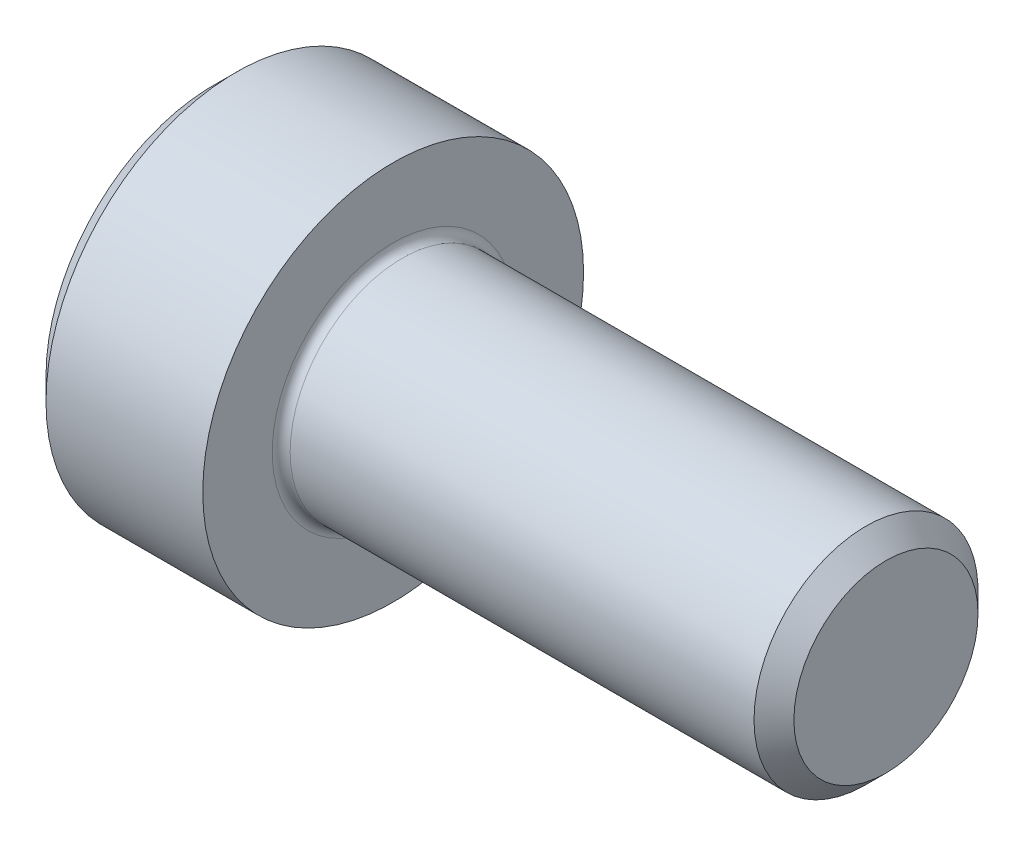
ISO-10303-21;
HEADER;
FILE_DESCRIPTION(('STEP AP214'),'2;1');
FILE_NAME('part.step','',(''),(''),'','','');
FILE_SCHEMA(('AUTOMOTIVE_DESIGN { 1 0 10303 214 1 1 1 1 }'));
ENDSEC;
DATA;
#1=APPLICATION_CONTEXT('core data for automotive mechanical design processes');
#2=APPLICATION_PROTOCOL_DEFINITION('international standard','automotive_design',2000,#1);
#3=PRODUCT_CONTEXT('',#1,'mechanical');
#4=PRODUCT('Part','Part','',(#3));
#5=PRODUCT_RELATED_PRODUCT_CATEGORY('part','',(#4));
#6=PRODUCT_DEFINITION_FORMATION('','',#4);
#7=PRODUCT_DEFINITION_CONTEXT('part definition',#1,'design');
#8=PRODUCT_DEFINITION('design','',#6,#7);
#9=PRODUCT_DEFINITION_SHAPE('','',#8);
#10=(LENGTH_UNIT() NAMED_UNIT(*) SI_UNIT(.MILLI.,.METRE.));
#11=(NAMED_UNIT(*) PLANE_ANGLE_UNIT() SI_UNIT($,.RADIAN.));
#12=(NAMED_UNIT(*) SI_UNIT($,.STERADIAN.) SOLID_ANGLE_UNIT());
#13=UNCERTAINTY_MEASURE_WITH_UNIT(LENGTH_MEASURE(1.E-05),#10,'distance_accuracy_value','');
#14=(GEOMETRIC_REPRESENTATION_CONTEXT(3) GLOBAL_UNCERTAINTY_ASSIGNED_CONTEXT((#13)) GLOBAL_UNIT_ASSIGNED_CONTEXT((#10,
#11,#12)) REPRESENTATION_CONTEXT('',''));
#15=CARTESIAN_POINT('',(0.,0.,0.));
#16=DIRECTION('',(0.,0.,1.));
#17=DIRECTION('',(1.,0.,0.));
#18=AXIS2_PLACEMENT_3D('',#15,#16,#17);
#19=CARTESIAN_POINT('',(0.,0.,0.));
#20=DIRECTION('',(-1.,0.,0.));
#21=DIRECTION('',(0.,0.,1.));
#22=AXIS2_PLACEMENT_3D('',#19,#20,#21);
#23=PLANE('',#22);
#24=DIRECTION('',(0.,-0.499999999999999,0.866025403784439));
#25=VECTOR('',#24,1.);
#26=CARTESIAN_POINT('',(0.,2.35789849937043,0.));
#27=LINE('',#26,#25);
#28=CARTESIAN_POINT('',(0.,2.35789849937043,0.));
#29=VERTEX_POINT('',#28);
#30=CARTESIAN_POINT('',(0.,1.17894924968522,2.042));
#31=VERTEX_POINT('',#30);
#32=EDGE_CURVE('E262',#29,#31,#27,.T.);
#33=ORIENTED_EDGE('',*,*,#32,.T.);
#34=DIRECTION('',(0.,1.,0.));
#35=VECTOR('',#34,1.);
#36=CARTESIAN_POINT('',(0.,-1.17894924968522,2.042));
#37=LINE('',#36,#35);
#38=CARTESIAN_POINT('',(0.,-1.17894924968522,2.042));
#39=VERTEX_POINT('',#38);
#40=EDGE_CURVE('E133',#39,#31,#37,.T.);
#41=ORIENTED_EDGE('',*,*,#40,.F.);
#42=DIRECTION('',(0.,-0.500000000000001,-0.866025403784438));
#43=VECTOR('',#42,1.);
#44=CARTESIAN_POINT('',(0.,-1.17894924968522,2.042));
#45=LINE('',#44,#43);
#46=CARTESIAN_POINT('',(0.,-2.35789849937043,0.));
#47=VERTEX_POINT('',#46);
#48=EDGE_CURVE('E265',#39,#47,#45,.T.);
#49=ORIENTED_EDGE('',*,*,#48,.T.);
#50=DIRECTION('',(0.,0.499999999999998,-0.86602540378444));
#51=VECTOR('',#50,1.);
#52=CARTESIAN_POINT('',(0.,-2.35789849937043,0.));
#53=LINE('',#52,#51);
#54=CARTESIAN_POINT('',(0.,-1.17894924968522,-2.042));
#55=VERTEX_POINT('',#54);
#56=EDGE_CURVE('E268',#47,#55,#53,.T.);
#57=ORIENTED_EDGE('',*,*,#56,.T.);
#58=DIRECTION('',(0.,-1.,0.));
#59=VECTOR('',#58,1.);
#60=CARTESIAN_POINT('',(0.,1.17894924968521,-2.042));
#61=LINE('',#60,#59);
#62=CARTESIAN_POINT('',(0.,1.17894924968521,-2.042));
#63=VERTEX_POINT('',#62);
#64=EDGE_CURVE('E271',#63,#55,#61,.T.);
#65=ORIENTED_EDGE('',*,*,#64,.F.);
#66=DIRECTION('',(0.,-0.500000000000001,-0.866025403784438));
#67=VECTOR('',#66,1.);
#68=CARTESIAN_POINT('',(0.,2.35789849937043,0.));
#69=LINE('',#68,#67);
#70=EDGE_CURVE('E128',#29,#63,#69,.T.);
#71=ORIENTED_EDGE('',*,*,#70,.F.);
#72=EDGE_LOOP('',(#33,#41,#49,#57,#65,#71));
#73=FACE_BOUND('',#72,.T.);
#74=CARTESIAN_POINT('',(0.,0.,0.));
#75=DIRECTION('',(-1.,0.,0.));
#76=DIRECTION('',(0.,0.,1.));
#77=AXIS2_PLACEMENT_3D('',#74,#75,#76);
#78=CIRCLE('',#77,3.75);
#79=CARTESIAN_POINT('',(0.,0.,3.75));
#80=VERTEX_POINT('',#79);
#81=EDGE_CURVE('E157',#80,#80,#78,.T.);
#82=ORIENTED_EDGE('',*,*,#81,.T.);
#83=EDGE_LOOP('',(#82));
#84=FACE_BOUND('',#83,.T.);
#85=ADVANCED_FACE('F37',(#73,#84),#23,.T.);
#86=CARTESIAN_POINT('',(0.,0.,0.));
#87=DIRECTION('',(1.,0.,0.));
#88=DIRECTION('',(0.,0.,-1.));
#89=AXIS2_PLACEMENT_3D('',#86,#87,#88);
#90=CONICAL_SURFACE('',#89,3.75,0.78539816339745);
#91=CARTESIAN_POINT('',(0.5,0.,0.));
#92=DIRECTION('',(-1.,0.,0.));
#93=DIRECTION('',(0.,0.,1.));
#94=AXIS2_PLACEMENT_3D('',#91,#92,#93);
#95=CIRCLE('',#94,4.25);
#96=CARTESIAN_POINT('',(0.5,0.,4.25));
#97=VERTEX_POINT('',#96);
#98=EDGE_CURVE('E154',#97,#97,#95,.T.);
#99=ORIENTED_EDGE('',*,*,#98,.T.);
#100=EDGE_LOOP('',(#99));
#101=FACE_BOUND('',#100,.T.);
#102=ORIENTED_EDGE('',*,*,#81,.F.);
#103=EDGE_LOOP('',(#102));
#104=FACE_BOUND('',#103,.T.);
#105=ADVANCED_FACE('F178',(#101,#104),#90,.T.);
#106=CARTESIAN_POINT('',(-31.75,0.,0.));
#107=DIRECTION('',(-1.,0.,0.));
#108=DIRECTION('',(0.,0.,1.));
#109=AXIS2_PLACEMENT_3D('',#106,#107,#108);
#110=CYLINDRICAL_SURFACE('',#109,4.25);
#111=CARTESIAN_POINT('',(4.,0.,0.));
#112=DIRECTION('',(-1.,0.,0.));
#113=DIRECTION('',(0.,0.,1.));
#114=AXIS2_PLACEMENT_3D('',#111,#112,#113);
#115=CIRCLE('',#114,4.25);
#116=CARTESIAN_POINT('',(4.,0.,4.25));
#117=VERTEX_POINT('',#116);
#118=EDGE_CURVE('E151',#117,#117,#115,.T.);
#119=ORIENTED_EDGE('',*,*,#118,.T.);
#120=EDGE_LOOP('',(#119));
#121=FACE_BOUND('',#120,.T.);
#122=ORIENTED_EDGE('',*,*,#98,.F.);
#123=EDGE_LOOP('',(#122));
#124=FACE_BOUND('',#123,.T.);
#125=ADVANCED_FACE('F183',(#121,#124),#110,.T.);
#126=CARTESIAN_POINT('',(4.,4.25,0.));
#127=DIRECTION('',(1.,0.,0.));
#128=DIRECTION('',(0.,0.,-1.));
#129=AXIS2_PLACEMENT_3D('',#126,#127,#128);
#130=PLANE('',#129);
#131=CARTESIAN_POINT('',(4.,0.,0.));
#132=DIRECTION('',(1.,0.,0.));
#133=DIRECTION('',(0.,0.,-1.));
#134=AXIS2_PLACEMENT_3D('',#131,#132,#133);
#135=CIRCLE('',#134,2.69999999999994);
#136=CARTESIAN_POINT('',(4.,0.,-2.69999999999994));
#137=VERTEX_POINT('',#136);
#138=EDGE_CURVE('E45',#137,#137,#135,.F.);
#139=ORIENTED_EDGE('',*,*,#138,.T.);
#140=EDGE_LOOP('',(#139));
#141=FACE_BOUND('',#140,.T.);
#142=ORIENTED_EDGE('',*,*,#118,.F.);
#143=EDGE_LOOP('',(#142));
#144=FACE_BOUND('',#143,.T.);
#145=ADVANCED_FACE('F162',(#141,#144),#130,.T.);
#146=CARTESIAN_POINT('',(-31.75,0.,0.));
#147=DIRECTION('',(-1.,0.,0.));
#148=DIRECTION('',(0.,0.,1.));
#149=AXIS2_PLACEMENT_3D('',#146,#147,#148);
#150=CYLINDRICAL_SURFACE('',#149,2.49999999999994);
#151=CARTESIAN_POINT('',(4.2,0.,0.));
#152=DIRECTION('',(1.,0.,0.));
#153=DIRECTION('',(0.,0.,-1.));
#154=AXIS2_PLACEMENT_3D('',#151,#152,#153);
#155=CIRCLE('',#154,2.49999999999994);
#156=CARTESIAN_POINT('',(4.2,0.,-2.49999999999994));
#157=VERTEX_POINT('',#156);
#158=EDGE_CURVE('E11',#157,#157,#155,.T.);
#159=ORIENTED_EDGE('',*,*,#158,.T.);
#160=EDGE_LOOP('',(#159));
#161=FACE_BOUND('',#160,.T.);
#162=CARTESIAN_POINT('',(14.5549999999999,0.,0.));
#163=DIRECTION('',(-1.,0.,0.));
#164=DIRECTION('',(0.,0.,1.));
#165=AXIS2_PLACEMENT_3D('',#162,#163,#164);
#166=CIRCLE('',#165,2.49999999999992);
#167=CARTESIAN_POINT('',(14.5549999999999,0.,2.49999999999992));
#168=VERTEX_POINT('',#167);
#169=EDGE_CURVE('E148',#168,#168,#166,.T.);
#170=ORIENTED_EDGE('',*,*,#169,.T.);
#171=EDGE_LOOP('',(#170));
#172=FACE_BOUND('',#171,.T.);
#173=ADVANCED_FACE('F193',(#161,#172),#150,.T.);
#174=CARTESIAN_POINT('',(15.,0.,0.));
#175=DIRECTION('',(-1.,0.,0.));
#176=DIRECTION('',(0.,0.,1.));
#177=AXIS2_PLACEMENT_3D('',#174,#175,#176);
#178=CONICAL_SURFACE('',#177,2.055,0.785398163397299);
#179=ORIENTED_EDGE('',*,*,#169,.F.);
#180=EDGE_LOOP('',(#179));
#181=FACE_BOUND('',#180,.T.);
#182=CARTESIAN_POINT('',(15.,0.,0.));
#183=DIRECTION('',(-1.,0.,0.));
#184=DIRECTION('',(0.,0.,1.));
#185=AXIS2_PLACEMENT_3D('',#182,#183,#184);
#186=CIRCLE('',#185,2.055);
#187=CARTESIAN_POINT('',(15.,0.,2.055));
#188=VERTEX_POINT('',#187);
#189=EDGE_CURVE('E144',#188,#188,#186,.T.);
#190=ORIENTED_EDGE('',*,*,#189,.T.);
#191=EDGE_LOOP('',(#190));
#192=FACE_BOUND('',#191,.T.);
#193=ADVANCED_FACE('F173',(#181,#192),#178,.T.);
#194=CARTESIAN_POINT('',(15.,2.055,0.));
#195=DIRECTION('',(1.,0.,0.));
#196=DIRECTION('',(0.,0.,-1.));
#197=AXIS2_PLACEMENT_3D('',#194,#195,#196);
#198=PLANE('',#197);
#199=ORIENTED_EDGE('',*,*,#189,.F.);
#200=EDGE_LOOP('',(#199));
#201=FACE_BOUND('',#200,.T.);
#202=ADVANCED_FACE('F166',(#201),#198,.T.);
#203=CARTESIAN_POINT('',(4.2,0.,0.));
#204=DIRECTION('',(1.,0.,0.));
#205=DIRECTION('',(0.,0.,-1.));
#206=AXIS2_PLACEMENT_3D('',#203,#204,#205);
#207=TOROIDAL_SURFACE('',#206,2.69999999999994,0.2);
#208=ORIENTED_EDGE('',*,*,#158,.F.);
#209=EDGE_LOOP('',(#208));
#210=FACE_BOUND('',#209,.T.);
#211=ORIENTED_EDGE('',*,*,#138,.F.);
#212=EDGE_LOOP('',(#211));
#213=FACE_BOUND('',#212,.T.);
#214=ADVANCED_FACE('F39',(#210,#213),#207,.F.);
#215=CARTESIAN_POINT('',(2.5,2.35789849937043,0.));
#216=DIRECTION('',(0.,-0.866025403784439,-0.499999999999999));
#217=DIRECTION('',(0.,0.499999999999999,-0.866025403784439));
#218=AXIS2_PLACEMENT_3D('',#215,#216,#217);
#219=PLANE('',#218);
#220=ORIENTED_EDGE('',*,*,#32,.F.);
#221=DIRECTION('',(-1.,0.,0.));
#222=VECTOR('',#221,1.);
#223=CARTESIAN_POINT('',(2.5,2.35789849937043,0.));
#224=LINE('',#223,#222);
#225=CARTESIAN_POINT('',(2.5,2.35789849937043,0.));
#226=VERTEX_POINT('',#225);
#227=EDGE_CURVE('E252',#226,#29,#224,.T.);
#228=ORIENTED_EDGE('',*,*,#227,.F.);
#229=DIRECTION('',(0.,-0.499999999999999,0.866025403784439));
#230=VECTOR('',#229,1.);
#231=CARTESIAN_POINT('',(2.5,2.35789849937043,0.));
#232=LINE('',#231,#230);
#233=CARTESIAN_POINT('',(2.5,1.76842387452782,1.021));
#234=VERTEX_POINT('',#233);
#235=EDGE_CURVE('E120',#226,#234,#232,.T.);
#236=ORIENTED_EDGE('',*,*,#235,.T.);
#237=CARTESIAN_POINT('',(2.5,1.17894924968522,2.042));
#238=VERTEX_POINT('',#237);
#239=EDGE_CURVE('E111',#234,#238,#232,.T.);
#240=ORIENTED_EDGE('',*,*,#239,.T.);
#241=DIRECTION('',(-1.,0.,0.));
#242=VECTOR('',#241,1.);
#243=CARTESIAN_POINT('',(2.5,1.17894924968522,2.042));
#244=LINE('',#243,#242);
#245=EDGE_CURVE('E125',#238,#31,#244,.T.);
#246=ORIENTED_EDGE('',*,*,#245,.T.);
#247=EDGE_LOOP('',(#220,#228,#236,#240,#246));
#248=FACE_BOUND('',#247,.T.);
#249=ADVANCED_FACE('F124',(#248),#219,.T.);
#250=CARTESIAN_POINT('',(2.5,-1.17894924968522,2.042));
#251=DIRECTION('',(0.,0.,1.));
#252=DIRECTION('',(0.,-1.,0.));
#253=AXIS2_PLACEMENT_3D('',#250,#251,#252);
#254=PLANE('',#253);
#255=ORIENTED_EDGE('',*,*,#40,.T.);
#256=ORIENTED_EDGE('',*,*,#245,.F.);
#257=DIRECTION('',(0.,1.,0.));
#258=VECTOR('',#257,1.);
#259=CARTESIAN_POINT('',(2.5,-1.17894924968522,2.042));
#260=LINE('',#259,#258);
#261=CARTESIAN_POINT('',(2.5,0.,2.042));
#262=VERTEX_POINT('',#261);
#263=EDGE_CURVE('E108',#262,#238,#260,.T.);
#264=ORIENTED_EDGE('',*,*,#263,.F.);
#265=CARTESIAN_POINT('',(2.5,-1.17894924968522,2.042));
#266=VERTEX_POINT('',#265);
#267=EDGE_CURVE('E119',#266,#262,#260,.T.);
#268=ORIENTED_EDGE('',*,*,#267,.F.);
#269=DIRECTION('',(-1.,0.,0.));
#270=VECTOR('',#269,1.);
#271=CARTESIAN_POINT('',(2.5,-1.17894924968522,2.042));
#272=LINE('',#271,#270);
#273=EDGE_CURVE('E135',#266,#39,#272,.T.);
#274=ORIENTED_EDGE('',*,*,#273,.T.);
#275=EDGE_LOOP('',(#255,#256,#264,#268,#274));
#276=FACE_BOUND('',#275,.T.);
#277=ADVANCED_FACE('F130',(#276),#254,.F.);
#278=CARTESIAN_POINT('',(2.5,-1.17894924968522,2.042));
#279=DIRECTION('',(0.,0.866025403784438,-0.500000000000001));
#280=DIRECTION('',(0.,0.500000000000001,0.866025403784438));
#281=AXIS2_PLACEMENT_3D('',#278,#279,#280);
#282=PLANE('',#281);
#283=ORIENTED_EDGE('',*,*,#48,.F.);
#284=ORIENTED_EDGE('',*,*,#273,.F.);
#285=DIRECTION('',(0.,-0.500000000000001,-0.866025403784438));
#286=VECTOR('',#285,1.);
#287=CARTESIAN_POINT('',(2.5,-1.17894924968522,2.042));
#288=LINE('',#287,#286);
#289=CARTESIAN_POINT('',(2.5,-1.76842387452782,1.021));
#290=VERTEX_POINT('',#289);
#291=EDGE_CURVE('E291',#266,#290,#288,.T.);
#292=ORIENTED_EDGE('',*,*,#291,.T.);
#293=CARTESIAN_POINT('',(2.5,-2.35789849937043,0.));
#294=VERTEX_POINT('',#293);
#295=EDGE_CURVE('E280',#290,#294,#288,.T.);
#296=ORIENTED_EDGE('',*,*,#295,.T.);
#297=DIRECTION('',(-1.,0.,0.));
#298=VECTOR('',#297,1.);
#299=CARTESIAN_POINT('',(2.5,-2.35789849937043,0.));
#300=LINE('',#299,#298);
#301=EDGE_CURVE('E140',#294,#47,#300,.T.);
#302=ORIENTED_EDGE('',*,*,#301,.T.);
#303=EDGE_LOOP('',(#283,#284,#292,#296,#302));
#304=FACE_BOUND('',#303,.T.);
#305=ADVANCED_FACE('F206',(#304),#282,.T.);
#306=CARTESIAN_POINT('',(2.5,-2.35789849937043,0.));
#307=DIRECTION('',(0.,0.86602540378444,0.499999999999998));
#308=DIRECTION('',(0.,-0.499999999999998,0.86602540378444));
#309=AXIS2_PLACEMENT_3D('',#306,#307,#308);
#310=PLANE('',#309);
#311=ORIENTED_EDGE('',*,*,#56,.F.);
#312=ORIENTED_EDGE('',*,*,#301,.F.);
#313=DIRECTION('',(0.,0.499999999999998,-0.86602540378444));
#314=VECTOR('',#313,1.);
#315=CARTESIAN_POINT('',(2.5,-2.35789849937043,0.));
#316=LINE('',#315,#314);
#317=CARTESIAN_POINT('',(2.5,-1.76842387452783,-1.021));
#318=VERTEX_POINT('',#317);
#319=EDGE_CURVE('E258',#294,#318,#316,.T.);
#320=ORIENTED_EDGE('',*,*,#319,.T.);
#321=CARTESIAN_POINT('',(2.5,-1.17894924968522,-2.042));
#322=VERTEX_POINT('',#321);
#323=EDGE_CURVE('E290',#318,#322,#316,.T.);
#324=ORIENTED_EDGE('',*,*,#323,.T.);
#325=DIRECTION('',(-1.,0.,0.));
#326=VECTOR('',#325,1.);
#327=CARTESIAN_POINT('',(2.5,-1.17894924968522,-2.042));
#328=LINE('',#327,#326);
#329=EDGE_CURVE('E251',#322,#55,#328,.T.);
#330=ORIENTED_EDGE('',*,*,#329,.T.);
#331=EDGE_LOOP('',(#311,#312,#320,#324,#330));
#332=FACE_BOUND('',#331,.T.);
#333=ADVANCED_FACE('F209',(#332),#310,.T.);
#334=CARTESIAN_POINT('',(2.5,1.17894924968521,-2.042));
#335=DIRECTION('',(0.,0.,-1.));
#336=DIRECTION('',(0.,1.,0.));
#337=AXIS2_PLACEMENT_3D('',#334,#335,#336);
#338=PLANE('',#337);
#339=ORIENTED_EDGE('',*,*,#64,.T.);
#340=ORIENTED_EDGE('',*,*,#329,.F.);
#341=DIRECTION('',(0.,-1.,0.));
#342=VECTOR('',#341,1.);
#343=CARTESIAN_POINT('',(2.5,1.17894924968521,-2.042));
#344=LINE('',#343,#342);
#345=CARTESIAN_POINT('',(2.5,0.,-2.042));
#346=VERTEX_POINT('',#345);
#347=EDGE_CURVE('E255',#346,#322,#344,.T.);
#348=ORIENTED_EDGE('',*,*,#347,.F.);
#349=CARTESIAN_POINT('',(2.5,1.17894924968521,-2.042));
#350=VERTEX_POINT('',#349);
#351=EDGE_CURVE('E52',#350,#346,#344,.T.);
#352=ORIENTED_EDGE('',*,*,#351,.F.);
#353=DIRECTION('',(-1.,0.,0.));
#354=VECTOR('',#353,1.);
#355=CARTESIAN_POINT('',(2.5,1.17894924968521,-2.042));
#356=LINE('',#355,#354);
#357=EDGE_CURVE('E248',#350,#63,#356,.T.);
#358=ORIENTED_EDGE('',*,*,#357,.T.);
#359=EDGE_LOOP('',(#339,#340,#348,#352,#358));
#360=FACE_BOUND('',#359,.T.);
#361=ADVANCED_FACE('F213',(#360),#338,.F.);
#362=CARTESIAN_POINT('',(2.5,2.35789849937043,0.));
#363=DIRECTION('',(0.,0.866025403784438,-0.500000000000001));
#364=DIRECTION('',(0.,0.500000000000001,0.866025403784438));
#365=AXIS2_PLACEMENT_3D('',#362,#363,#364);
#366=PLANE('',#365);
#367=ORIENTED_EDGE('',*,*,#70,.T.);
#368=ORIENTED_EDGE('',*,*,#357,.F.);
#369=DIRECTION('',(0.,-0.500000000000001,-0.866025403784438));
#370=VECTOR('',#369,1.);
#371=CARTESIAN_POINT('',(2.5,2.35789849937043,0.));
#372=LINE('',#371,#370);
#373=CARTESIAN_POINT('',(2.5,1.76842387452782,-1.021));
#374=VERTEX_POINT('',#373);
#375=EDGE_CURVE('E238',#374,#350,#372,.T.);
#376=ORIENTED_EDGE('',*,*,#375,.F.);
#377=EDGE_CURVE('E244',#226,#374,#372,.T.);
#378=ORIENTED_EDGE('',*,*,#377,.F.);
#379=ORIENTED_EDGE('',*,*,#227,.T.);
#380=EDGE_LOOP('',(#367,#368,#376,#378,#379));
#381=FACE_BOUND('',#380,.T.);
#382=ADVANCED_FACE('F217',(#381),#366,.F.);
#383=CARTESIAN_POINT('',(2.5,3.53684774905564,-2.04200000000001));
#384=DIRECTION('',(1.,0.,0.));
#385=DIRECTION('',(0.,0.,-1.));
#386=AXIS2_PLACEMENT_3D('',#383,#384,#385);
#387=PLANE('',#386);
#388=ORIENTED_EDGE('',*,*,#347,.T.);
#389=ORIENTED_EDGE('',*,*,#323,.F.);
#390=CARTESIAN_POINT('',(2.5,0.,0.));
#391=DIRECTION('',(-1.,0.,0.));
#392=DIRECTION('',(0.,0.,1.));
#393=AXIS2_PLACEMENT_3D('',#390,#391,#392);
#394=CIRCLE('',#393,2.042);
#395=EDGE_CURVE('E286',#346,#318,#394,.T.);
#396=ORIENTED_EDGE('',*,*,#395,.F.);
#397=EDGE_LOOP('',(#388,#389,#396));
#398=FACE_BOUND('',#397,.T.);
#399=ADVANCED_FACE('F221',(#398),#387,.F.);
#400=ORIENTED_EDGE('',*,*,#319,.F.);
#401=ORIENTED_EDGE('',*,*,#295,.F.);
#402=EDGE_CURVE('E138',#318,#290,#394,.T.);
#403=ORIENTED_EDGE('',*,*,#402,.F.);
#404=EDGE_LOOP('',(#400,#401,#403));
#405=FACE_BOUND('',#404,.T.);
#406=ADVANCED_FACE('F224',(#405),#387,.F.);
#407=ORIENTED_EDGE('',*,*,#291,.F.);
#408=ORIENTED_EDGE('',*,*,#267,.T.);
#409=EDGE_CURVE('E134',#290,#262,#394,.T.);
#410=ORIENTED_EDGE('',*,*,#409,.F.);
#411=EDGE_LOOP('',(#407,#408,#410));
#412=FACE_BOUND('',#411,.T.);
#413=ADVANCED_FACE('F229',(#412),#387,.F.);
#414=ORIENTED_EDGE('',*,*,#263,.T.);
#415=ORIENTED_EDGE('',*,*,#239,.F.);
#416=EDGE_CURVE('E114',#262,#234,#394,.T.);
#417=ORIENTED_EDGE('',*,*,#416,.F.);
#418=EDGE_LOOP('',(#414,#415,#417));
#419=FACE_BOUND('',#418,.T.);
#420=ADVANCED_FACE('F110',(#419),#387,.F.);
#421=ORIENTED_EDGE('',*,*,#235,.F.);
#422=ORIENTED_EDGE('',*,*,#377,.T.);
#423=EDGE_CURVE('E145',#234,#374,#394,.T.);
#424=ORIENTED_EDGE('',*,*,#423,.F.);
#425=EDGE_LOOP('',(#421,#422,#424));
#426=FACE_BOUND('',#425,.T.);
#427=ADVANCED_FACE('F232',(#426),#387,.F.);
#428=ORIENTED_EDGE('',*,*,#375,.T.);
#429=ORIENTED_EDGE('',*,*,#351,.T.);
#430=EDGE_CURVE('E241',#374,#346,#394,.T.);
#431=ORIENTED_EDGE('',*,*,#430,.F.);
#432=EDGE_LOOP('',(#428,#429,#431));
#433=FACE_BOUND('',#432,.T.);
#434=ADVANCED_FACE('F202',(#433),#387,.F.);
#435=CARTESIAN_POINT('',(2.5,0.,0.));
#436=DIRECTION('',(-1.,0.,0.));
#437=DIRECTION('',(0.,0.,1.));
#438=AXIS2_PLACEMENT_3D('',#435,#436,#437);
#439=CONICAL_SURFACE('',#438,2.042,1.04719755119659);
#440=CARTESIAN_POINT('',(3.67894924968523,0.,0.));
#441=VERTEX_POINT('',#440);
#442=VERTEX_LOOP('',#441);
#443=FACE_BOUND('',#442,.T.);
#444=ORIENTED_EDGE('',*,*,#416,.T.);
#445=ORIENTED_EDGE('',*,*,#423,.T.);
#446=ORIENTED_EDGE('',*,*,#430,.T.);
#447=ORIENTED_EDGE('',*,*,#395,.T.);
#448=ORIENTED_EDGE('',*,*,#402,.T.);
#449=ORIENTED_EDGE('',*,*,#409,.T.);
#450=EDGE_LOOP('',(#444,#445,#446,#447,#448,#449));
#451=FACE_BOUND('',#450,.T.);
#452=ADVANCED_FACE('F200',(#443,#451),#439,.F.);
#453=CLOSED_SHELL('',(#85,#105,#125,#145,#173,#193,#202,#214,#249,#277,#305,#333,#361,#382,#399,
#406,#413,#420,#427,#434,#452));
#454=MANIFOLD_SOLID_BREP('B2',#453);
#455=ADVANCED_BREP_SHAPE_REPRESENTATION('',(#18,#454),#14);
#456=SHAPE_DEFINITION_REPRESENTATION(#9,#455);
ENDSEC;
END-ISO-10303-21;
